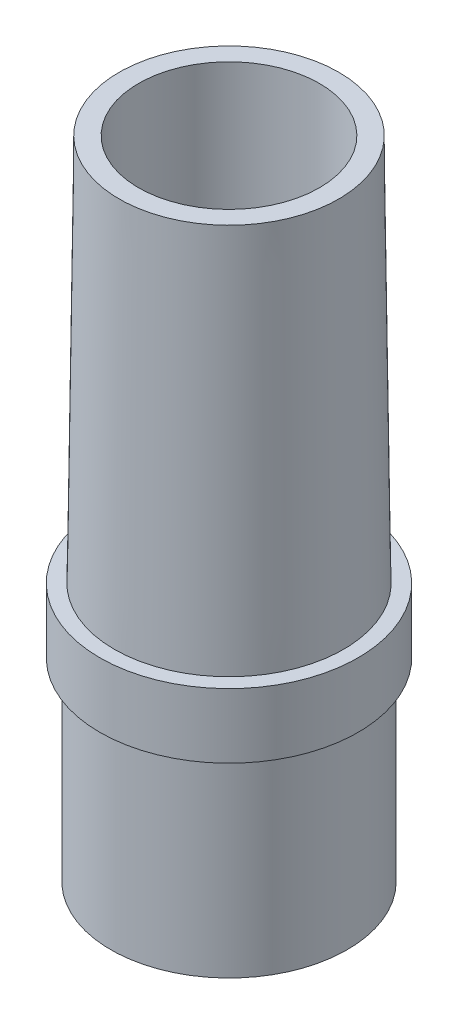
ISO-10303-21;
HEADER;
FILE_DESCRIPTION(('STEP AP214'),'2;1');
FILE_NAME('part.step','',(''),(''),'','','');
FILE_SCHEMA(('AUTOMOTIVE_DESIGN { 1 0 10303 214 1 1 1 1 }'));
ENDSEC;
DATA;
#1=APPLICATION_CONTEXT('core data for automotive mechanical design processes');
#2=APPLICATION_PROTOCOL_DEFINITION('international standard','automotive_design',2000,#1);
#3=PRODUCT_CONTEXT('',#1,'mechanical');
#4=PRODUCT('Part','Part','',(#3));
#5=PRODUCT_RELATED_PRODUCT_CATEGORY('part','',(#4));
#6=PRODUCT_DEFINITION_FORMATION('','',#4);
#7=PRODUCT_DEFINITION_CONTEXT('part definition',#1,'design');
#8=PRODUCT_DEFINITION('design','',#6,#7);
#9=PRODUCT_DEFINITION_SHAPE('','',#8);
#10=(LENGTH_UNIT() NAMED_UNIT(*) SI_UNIT(.MILLI.,.METRE.));
#11=(NAMED_UNIT(*) PLANE_ANGLE_UNIT() SI_UNIT($,.RADIAN.));
#12=(NAMED_UNIT(*) SI_UNIT($,.STERADIAN.) SOLID_ANGLE_UNIT());
#13=UNCERTAINTY_MEASURE_WITH_UNIT(LENGTH_MEASURE(1.E-05),#10,'distance_accuracy_value','');
#14=(GEOMETRIC_REPRESENTATION_CONTEXT(3) GLOBAL_UNCERTAINTY_ASSIGNED_CONTEXT((#13)) GLOBAL_UNIT_ASSIGNED_CONTEXT((#10,
#11,#12)) REPRESENTATION_CONTEXT('',''));
#15=CARTESIAN_POINT('',(0.,0.,0.));
#16=DIRECTION('',(0.,0.,1.));
#17=DIRECTION('',(1.,0.,0.));
#18=AXIS2_PLACEMENT_3D('',#15,#16,#17);
#19=CARTESIAN_POINT('',(0.,100.,0.));
#20=DIRECTION('',(0.,1.,0.));
#21=DIRECTION('',(0.,0.,1.));
#22=AXIS2_PLACEMENT_3D('',#19,#20,#21);
#23=PLANE('',#22);
#24=CARTESIAN_POINT('',(0.,100.,0.));
#25=DIRECTION('',(0.,1.,0.));
#26=DIRECTION('',(1.,0.,0.));
#27=AXIS2_PLACEMENT_3D('',#24,#25,#26);
#28=CIRCLE('',#27,14.);
#29=CARTESIAN_POINT('',(14.,100.,0.));
#30=VERTEX_POINT('',#29);
#31=EDGE_CURVE('E11',#30,#30,#28,.T.);
#32=ORIENTED_EDGE('',*,*,#31,.F.);
#33=EDGE_LOOP('',(#32));
#34=FACE_BOUND('',#33,.T.);
#35=CARTESIAN_POINT('',(0.,100.,0.));
#36=DIRECTION('',(0.,-1.,0.));
#37=DIRECTION('',(0.,0.,-1.));
#38=AXIS2_PLACEMENT_3D('',#35,#36,#37);
#39=CIRCLE('',#38,17.);
#40=CARTESIAN_POINT('',(0.,100.,-17.));
#41=VERTEX_POINT('',#40);
#42=EDGE_CURVE('E65',#41,#41,#39,.T.);
#43=ORIENTED_EDGE('',*,*,#42,.F.);
#44=EDGE_LOOP('',(#43));
#45=FACE_BOUND('',#44,.T.);
#46=ADVANCED_FACE('F43',(#34,#45),#23,.T.);
#47=CARTESIAN_POINT('',(0.,0.,0.));
#48=DIRECTION('',(0.,1.,0.));
#49=DIRECTION('',(0.,0.,1.));
#50=AXIS2_PLACEMENT_3D('',#47,#48,#49);
#51=PLANE('',#50);
#52=CARTESIAN_POINT('',(0.,0.,0.));
#53=DIRECTION('',(0.,-1.,0.));
#54=DIRECTION('',(0.,0.,-1.));
#55=AXIS2_PLACEMENT_3D('',#52,#53,#54);
#56=CIRCLE('',#55,18.3);
#57=CARTESIAN_POINT('',(0.,0.,-18.3));
#58=VERTEX_POINT('',#57);
#59=EDGE_CURVE('E54',#58,#58,#56,.T.);
#60=ORIENTED_EDGE('',*,*,#59,.T.);
#61=EDGE_LOOP('',(#60));
#62=FACE_BOUND('',#61,.T.);
#63=CARTESIAN_POINT('',(0.,0.,0.));
#64=DIRECTION('',(0.,1.,0.));
#65=DIRECTION('',(1.,0.,0.));
#66=AXIS2_PLACEMENT_3D('',#63,#64,#65);
#67=CIRCLE('',#66,14.);
#68=CARTESIAN_POINT('',(14.,0.,0.));
#69=VERTEX_POINT('',#68);
#70=EDGE_CURVE('E47',#69,#69,#67,.T.);
#71=ORIENTED_EDGE('',*,*,#70,.T.);
#72=EDGE_LOOP('',(#71));
#73=FACE_BOUND('',#72,.T.);
#74=ADVANCED_FACE('F104',(#62,#73),#51,.F.);
#75=CARTESIAN_POINT('',(0.,100.,0.));
#76=DIRECTION('',(0.,-1.,0.));
#77=DIRECTION('',(0.,0.,-1.));
#78=AXIS2_PLACEMENT_3D('',#75,#76,#77);
#79=CYLINDRICAL_SURFACE('',#78,14.);
#80=ORIENTED_EDGE('',*,*,#31,.T.);
#81=EDGE_LOOP('',(#80));
#82=FACE_BOUND('',#81,.T.);
#83=ORIENTED_EDGE('',*,*,#70,.F.);
#84=EDGE_LOOP('',(#83));
#85=FACE_BOUND('',#84,.T.);
#86=ADVANCED_FACE('F94',(#82,#85),#79,.F.);
#87=CARTESIAN_POINT('',(0.,40.0015623169184,-17.7499804710385));
#88=DIRECTION('',(0.,-1.,0.));
#89=DIRECTION('',(0.,0.,-1.));
#90=AXIS2_PLACEMENT_3D('',#87,#88,#89);
#91=PLANE('',#90);
#92=CARTESIAN_POINT('',(0.,40.0015623169184,0.));
#93=DIRECTION('',(0.,-1.,0.));
#94=DIRECTION('',(0.,0.,-1.));
#95=AXIS2_PLACEMENT_3D('',#92,#93,#94);
#96=CIRCLE('',#95,20.);
#97=CARTESIAN_POINT('',(0.,40.0015623169184,-20.));
#98=VERTEX_POINT('',#97);
#99=EDGE_CURVE('E56',#98,#98,#96,.T.);
#100=ORIENTED_EDGE('',*,*,#99,.F.);
#101=EDGE_LOOP('',(#100));
#102=FACE_BOUND('',#101,.T.);
#103=CARTESIAN_POINT('',(0.,40.0015623169184,0.));
#104=DIRECTION('',(0.,-1.,0.));
#105=DIRECTION('',(0.,0.,-1.));
#106=AXIS2_PLACEMENT_3D('',#103,#104,#105);
#107=CIRCLE('',#106,17.7499804710385);
#108=CARTESIAN_POINT('',(0.,40.0015623169184,-17.7499804710385));
#109=VERTEX_POINT('',#108);
#110=EDGE_CURVE('E61',#109,#109,#107,.T.);
#111=ORIENTED_EDGE('',*,*,#110,.T.);
#112=EDGE_LOOP('',(#111));
#113=FACE_BOUND('',#112,.T.);
#114=ADVANCED_FACE('F90',(#102,#113),#91,.F.);
#115=CARTESIAN_POINT('',(0.,100.,0.));
#116=DIRECTION('',(0.,-1.,0.));
#117=DIRECTION('',(0.,0.,-1.));
#118=AXIS2_PLACEMENT_3D('',#115,#116,#117);
#119=CONICAL_SURFACE('',#118,17.,0.0124993490193616);
#120=ORIENTED_EDGE('',*,*,#110,.F.);
#121=EDGE_LOOP('',(#120));
#122=FACE_BOUND('',#121,.T.);
#123=ORIENTED_EDGE('',*,*,#42,.T.);
#124=EDGE_LOOP('',(#123));
#125=FACE_BOUND('',#124,.T.);
#126=ADVANCED_FACE('F93',(#122,#125),#119,.T.);
#127=CARTESIAN_POINT('',(0.,-5.8550870796323,0.));
#128=DIRECTION('',(0.,-1.,0.));
#129=DIRECTION('',(0.,0.,-1.));
#130=AXIS2_PLACEMENT_3D('',#127,#128,#129);
#131=CYLINDRICAL_SURFACE('',#130,18.3);
#132=ORIENTED_EDGE('',*,*,#59,.F.);
#133=EDGE_LOOP('',(#132));
#134=FACE_BOUND('',#133,.T.);
#135=CARTESIAN_POINT('',(0.,30.,0.));
#136=DIRECTION('',(0.,-1.,0.));
#137=DIRECTION('',(0.,0.,-1.));
#138=AXIS2_PLACEMENT_3D('',#135,#136,#137);
#139=CIRCLE('',#138,18.3);
#140=CARTESIAN_POINT('',(0.,30.,-18.3));
#141=VERTEX_POINT('',#140);
#142=EDGE_CURVE('E60',#141,#141,#139,.T.);
#143=ORIENTED_EDGE('',*,*,#142,.T.);
#144=EDGE_LOOP('',(#143));
#145=FACE_BOUND('',#144,.T.);
#146=ADVANCED_FACE('F78',(#134,#145),#131,.T.);
#147=CARTESIAN_POINT('',(0.,30.,-18.3));
#148=DIRECTION('',(0.,1.,0.));
#149=DIRECTION('',(0.,0.,1.));
#150=AXIS2_PLACEMENT_3D('',#147,#148,#149);
#151=PLANE('',#150);
#152=ORIENTED_EDGE('',*,*,#142,.F.);
#153=EDGE_LOOP('',(#152));
#154=FACE_BOUND('',#153,.T.);
#155=CARTESIAN_POINT('',(0.,30.,0.));
#156=DIRECTION('',(0.,-1.,0.));
#157=DIRECTION('',(0.,0.,-1.));
#158=AXIS2_PLACEMENT_3D('',#155,#156,#157);
#159=CIRCLE('',#158,20.);
#160=CARTESIAN_POINT('',(0.,30.,-20.));
#161=VERTEX_POINT('',#160);
#162=EDGE_CURVE('E70',#161,#161,#159,.T.);
#163=ORIENTED_EDGE('',*,*,#162,.T.);
#164=EDGE_LOOP('',(#163));
#165=FACE_BOUND('',#164,.T.);
#166=ADVANCED_FACE('F80',(#154,#165),#151,.F.);
#167=CARTESIAN_POINT('',(0.,100.,0.));
#168=DIRECTION('',(0.,-1.,0.));
#169=DIRECTION('',(0.,0.,-1.));
#170=AXIS2_PLACEMENT_3D('',#167,#168,#169);
#171=CYLINDRICAL_SURFACE('',#170,20.);
#172=ORIENTED_EDGE('',*,*,#162,.F.);
#173=EDGE_LOOP('',(#172));
#174=FACE_BOUND('',#173,.T.);
#175=ORIENTED_EDGE('',*,*,#99,.T.);
#176=EDGE_LOOP('',(#175));
#177=FACE_BOUND('',#176,.T.);
#178=ADVANCED_FACE('F45',(#174,#177),#171,.T.);
#179=CLOSED_SHELL('',(#46,#74,#86,#114,#126,#146,#166,#178));
#180=MANIFOLD_SOLID_BREP('B2',#179);
#181=ADVANCED_BREP_SHAPE_REPRESENTATION('',(#18,#180),#14);
#182=SHAPE_DEFINITION_REPRESENTATION(#9,#181);
ENDSEC;
END-ISO-10303-21;
